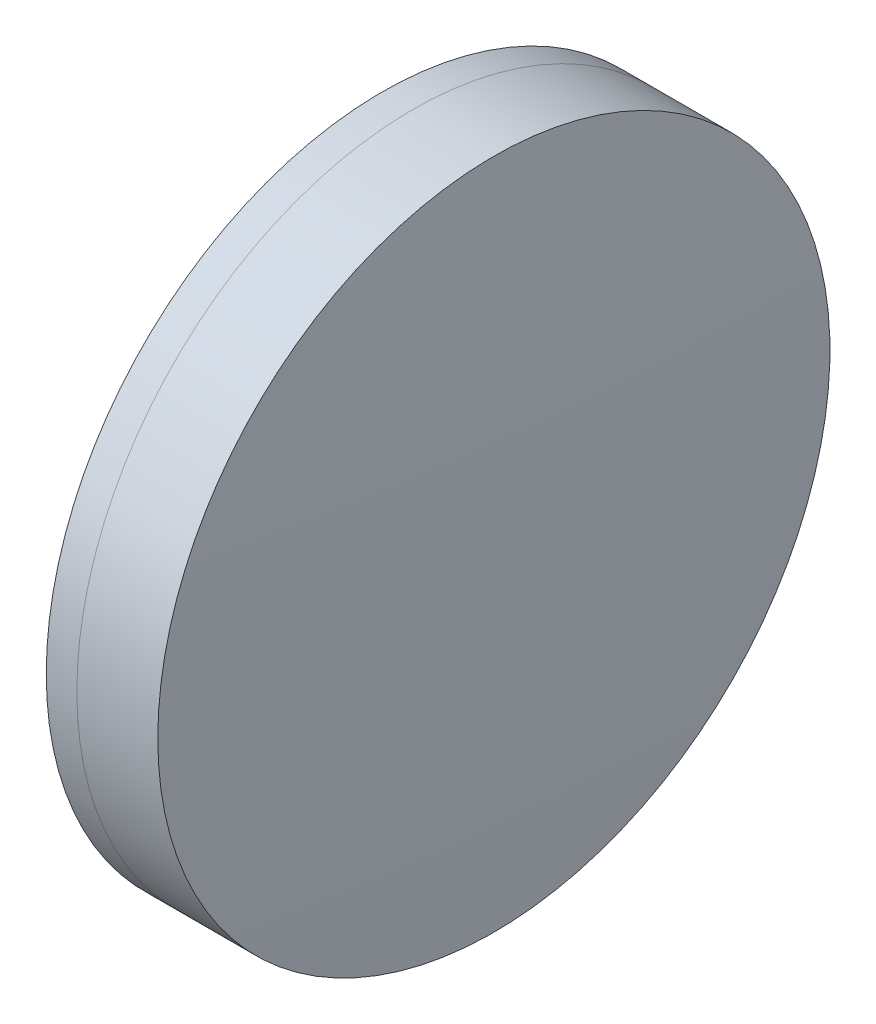
ISO-10303-21;
HEADER;
FILE_DESCRIPTION(('STEP AP214'),'2;1');
FILE_NAME('part.step','',(''),(''),'','','');
FILE_SCHEMA(('AUTOMOTIVE_DESIGN { 1 0 10303 214 1 1 1 1 }'));
ENDSEC;
DATA;
#1=APPLICATION_CONTEXT('core data for automotive mechanical design processes');
#2=APPLICATION_PROTOCOL_DEFINITION('international standard','automotive_design',2000,#1);
#3=PRODUCT_CONTEXT('',#1,'mechanical');
#4=PRODUCT('Part','Part','',(#3));
#5=PRODUCT_RELATED_PRODUCT_CATEGORY('part','',(#4));
#6=PRODUCT_DEFINITION_FORMATION('','',#4);
#7=PRODUCT_DEFINITION_CONTEXT('part definition',#1,'design');
#8=PRODUCT_DEFINITION('design','',#6,#7);
#9=PRODUCT_DEFINITION_SHAPE('','',#8);
#10=(LENGTH_UNIT() NAMED_UNIT(*) SI_UNIT(.MILLI.,.METRE.));
#11=(NAMED_UNIT(*) PLANE_ANGLE_UNIT() SI_UNIT($,.RADIAN.));
#12=(NAMED_UNIT(*) SI_UNIT($,.STERADIAN.) SOLID_ANGLE_UNIT());
#13=UNCERTAINTY_MEASURE_WITH_UNIT(LENGTH_MEASURE(1.E-05),#10,'distance_accuracy_value','');
#14=(GEOMETRIC_REPRESENTATION_CONTEXT(3) GLOBAL_UNCERTAINTY_ASSIGNED_CONTEXT((#13)) GLOBAL_UNIT_ASSIGNED_CONTEXT((#10,
#11,#12)) REPRESENTATION_CONTEXT('',''));
#15=CARTESIAN_POINT('',(0.,0.,0.));
#16=DIRECTION('',(0.,0.,1.));
#17=DIRECTION('',(1.,0.,0.));
#18=AXIS2_PLACEMENT_3D('',#15,#16,#17);
#19=CARTESIAN_POINT('',(180.900500738752,0.,0.));
#20=DIRECTION('',(-1.,0.,0.));
#21=DIRECTION('',(0.,0.,1.));
#22=AXIS2_PLACEMENT_3D('',#19,#20,#21);
#23=SPHERICAL_SURFACE('',#22,57.0000000000003);
#24=CARTESIAN_POINT('',(235.891409078223,0.,0.));
#25=DIRECTION('',(-1.,0.,0.));
#26=DIRECTION('',(0.,0.,1.));
#27=AXIS2_PLACEMENT_3D('',#24,#25,#26);
#28=CIRCLE('',#27,14.9999999999999);
#29=CARTESIAN_POINT('',(235.891409078223,0.,14.9999999999999));
#30=VERTEX_POINT('',#29);
#31=EDGE_CURVE('E11',#30,#30,#28,.T.);
#32=ORIENTED_EDGE('',*,*,#31,.T.);
#33=EDGE_LOOP('',(#32));
#34=FACE_BOUND('',#33,.T.);
#35=ADVANCED_FACE('F45',(#34),#23,.F.);
#36=CARTESIAN_POINT('',(-0.551919992657797,0.,0.));
#37=DIRECTION('',(-1.,0.,0.));
#38=DIRECTION('',(0.,0.,1.));
#39=AXIS2_PLACEMENT_3D('',#36,#37,#38);
#40=CYLINDRICAL_SURFACE('',#39,14.9999999999999);
#41=CARTESIAN_POINT('',(239.504655637937,0.,0.));
#42=DIRECTION('',(-1.,0.,0.));
#43=DIRECTION('',(0.,0.,1.));
#44=AXIS2_PLACEMENT_3D('',#41,#42,#43);
#45=CIRCLE('',#44,14.9999999999999);
#46=CARTESIAN_POINT('',(239.504655637937,0.,14.9999999999999));
#47=VERTEX_POINT('',#46);
#48=EDGE_CURVE('E51',#47,#47,#45,.T.);
#49=ORIENTED_EDGE('',*,*,#48,.T.);
#50=EDGE_LOOP('',(#49));
#51=FACE_BOUND('',#50,.T.);
#52=ORIENTED_EDGE('',*,*,#31,.F.);
#53=EDGE_LOOP('',(#52));
#54=FACE_BOUND('',#53,.T.);
#55=ADVANCED_FACE('F57',(#51,#54),#40,.T.);
#56=CARTESIAN_POINT('',(-44.4994992612475,0.,0.));
#57=DIRECTION('',(-1.,0.,0.));
#58=DIRECTION('',(0.,0.,1.));
#59=AXIS2_PLACEMENT_3D('',#56,#57,#58);
#60=SPHERICAL_SURFACE('',#59,284.4);
#61=ORIENTED_EDGE('',*,*,#48,.F.);
#62=EDGE_LOOP('',(#61));
#63=FACE_BOUND('',#62,.T.);
#64=ADVANCED_FACE('F60',(#63),#60,.T.);
#65=CLOSED_SHELL('',(#35,#55,#64));
#66=MANIFOLD_SOLID_BREP('B2',#65);
#67=CARTESIAN_POINT('',(302.900500738752,0.,-2.19884740896409E-13));
#68=DIRECTION('',(-1.,0.,0.));
#69=DIRECTION('',(0.,0.,1.));
#70=AXIS2_PLACEMENT_3D('',#67,#68,#69);
#71=SPHERICAL_SURFACE('',#70,70.);
#72=CARTESIAN_POINT('',(234.526529082866,0.,0.));
#73=DIRECTION('',(-1.,0.,0.));
#74=DIRECTION('',(0.,0.,1.));
#75=AXIS2_PLACEMENT_3D('',#72,#73,#74);
#76=CIRCLE('',#75,14.9999999999999);
#77=CARTESIAN_POINT('',(234.526529082866,0.,14.9999999999999));
#78=VERTEX_POINT('',#77);
#79=EDGE_CURVE('E44',#78,#78,#76,.T.);
#80=ORIENTED_EDGE('',*,*,#79,.T.);
#81=EDGE_LOOP('',(#80));
#82=FACE_BOUND('',#81,.T.);
#83=ADVANCED_FACE('F86',(#82),#71,.T.);
#84=CARTESIAN_POINT('',(124.523309526045,0.,0.));
#85=DIRECTION('',(-1.,0.,0.));
#86=DIRECTION('',(0.,0.,1.));
#87=AXIS2_PLACEMENT_3D('',#84,#85,#86);
#88=CYLINDRICAL_SURFACE('',#87,14.9999999999999);
#89=CARTESIAN_POINT('',(235.891409078223,0.,0.));
#90=DIRECTION('',(-1.,0.,0.));
#91=DIRECTION('',(0.,0.,1.));
#92=AXIS2_PLACEMENT_3D('',#89,#90,#91);
#93=CIRCLE('',#92,14.9999999999999);
#94=CARTESIAN_POINT('',(235.891409078223,0.,14.9999999999999));
#95=VERTEX_POINT('',#94);
#96=EDGE_CURVE('E92',#95,#95,#93,.T.);
#97=ORIENTED_EDGE('',*,*,#96,.T.);
#98=EDGE_LOOP('',(#97));
#99=FACE_BOUND('',#98,.T.);
#100=ORIENTED_EDGE('',*,*,#79,.F.);
#101=EDGE_LOOP('',(#100));
#102=FACE_BOUND('',#101,.T.);
#103=ADVANCED_FACE('F98',(#99,#102),#88,.T.);
#104=CARTESIAN_POINT('',(180.900500738752,0.,0.));
#105=DIRECTION('',(-1.,0.,0.));
#106=DIRECTION('',(0.,0.,1.));
#107=AXIS2_PLACEMENT_3D('',#104,#105,#106);
#108=SPHERICAL_SURFACE('',#107,57.0000000000003);
#109=ORIENTED_EDGE('',*,*,#96,.F.);
#110=EDGE_LOOP('',(#109));
#111=FACE_BOUND('',#110,.T.);
#112=ADVANCED_FACE('F101',(#111),#108,.T.);
#113=CLOSED_SHELL('',(#83,#103,#112));
#114=MANIFOLD_SOLID_BREP('B6',#113);
#115=ADVANCED_BREP_SHAPE_REPRESENTATION('',(#18,#66,#114),#14);
#116=SHAPE_DEFINITION_REPRESENTATION(#9,#115);
ENDSEC;
END-ISO-10303-21;
